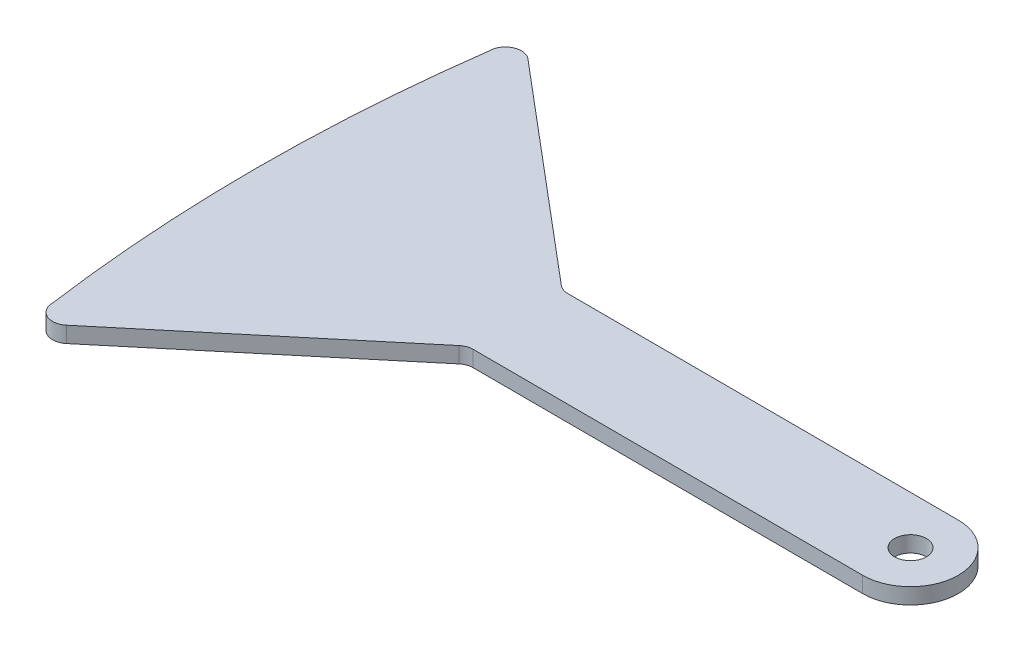
ISO-10303-21;
HEADER;
FILE_DESCRIPTION(('STEP AP214'),'2;1');
FILE_NAME('part.step','',(''),(''),'','','');
FILE_SCHEMA(('AUTOMOTIVE_DESIGN { 1 0 10303 214 1 1 1 1 }'));
ENDSEC;
DATA;
#1=APPLICATION_CONTEXT('core data for automotive mechanical design processes');
#2=APPLICATION_PROTOCOL_DEFINITION('international standard','automotive_design',2000,#1);
#3=PRODUCT_CONTEXT('',#1,'mechanical');
#4=PRODUCT('Part','Part','',(#3));
#5=PRODUCT_RELATED_PRODUCT_CATEGORY('part','',(#4));
#6=PRODUCT_DEFINITION_FORMATION('','',#4);
#7=PRODUCT_DEFINITION_CONTEXT('part definition',#1,'design');
#8=PRODUCT_DEFINITION('design','',#6,#7);
#9=PRODUCT_DEFINITION_SHAPE('','',#8);
#10=(LENGTH_UNIT() NAMED_UNIT(*) SI_UNIT(.MILLI.,.METRE.));
#11=(NAMED_UNIT(*) PLANE_ANGLE_UNIT() SI_UNIT($,.RADIAN.));
#12=(NAMED_UNIT(*) SI_UNIT($,.STERADIAN.) SOLID_ANGLE_UNIT());
#13=UNCERTAINTY_MEASURE_WITH_UNIT(LENGTH_MEASURE(1.E-05),#10,'distance_accuracy_value','');
#14=(GEOMETRIC_REPRESENTATION_CONTEXT(3) GLOBAL_UNCERTAINTY_ASSIGNED_CONTEXT((#13)) GLOBAL_UNIT_ASSIGNED_CONTEXT((#10,
#11,#12)) REPRESENTATION_CONTEXT('',''));
#15=CARTESIAN_POINT('',(0.,0.,0.));
#16=DIRECTION('',(0.,0.,1.));
#17=DIRECTION('',(1.,0.,0.));
#18=AXIS2_PLACEMENT_3D('',#15,#16,#17);
#19=CARTESIAN_POINT('',(25.,1.,0.));
#20=DIRECTION('',(0.,1.,0.));
#21=DIRECTION('',(0.,0.,1.));
#22=AXIS2_PLACEMENT_3D('',#19,#20,#21);
#23=PLANE('',#22);
#24=CARTESIAN_POINT('',(25.,1.,0.));
#25=DIRECTION('',(0.,1.,0.));
#26=DIRECTION('',(0.,0.,1.));
#27=AXIS2_PLACEMENT_3D('',#24,#25,#26);
#28=CIRCLE('',#27,3.);
#29=CARTESIAN_POINT('',(24.9930718982372,1.,2.99999200022366));
#30=VERTEX_POINT('',#29);
#31=CARTESIAN_POINT('',(25.0069281017628,1.,-2.99999200022366));
#32=VERTEX_POINT('',#31);
#33=EDGE_CURVE('E183',#30,#32,#28,.T.);
#34=ORIENTED_EDGE('',*,*,#33,.T.);
#35=DIRECTION('',(-0.999997333407887,0.,-0.00230936725425648));
#36=VECTOR('',#35,1.);
#37=CARTESIAN_POINT('',(0.435948957199872,1.,-3.05673556617708));
#38=LINE('',#37,#36);
#39=CARTESIAN_POINT('',(0.435948957199872,1.,-3.05673556617708));
#40=VERTEX_POINT('',#39);
#41=EDGE_CURVE('E107',#32,#40,#38,.T.);
#42=ORIENTED_EDGE('',*,*,#41,.T.);
#43=CARTESIAN_POINT('',(0.438258324454125,1.,-4.05673289958497));
#44=DIRECTION('',(0.,-1.,0.));
#45=DIRECTION('',(0.,0.,-1.));
#46=AXIS2_PLACEMENT_3D('',#43,#44,#45);
#47=CIRCLE('',#46,1.);
#48=CARTESIAN_POINT('',(-0.206296649132287,1.,-3.29217493185131));
#49=VERTEX_POINT('',#48);
#50=EDGE_CURVE('E233',#40,#49,#47,.T.);
#51=ORIENTED_EDGE('',*,*,#50,.T.);
#52=DIRECTION('',(-0.76455796773366,0.,-0.644554973586409));
#53=VECTOR('',#52,1.);
#54=CARTESIAN_POINT('',(-0.206296649132287,1.,-3.29217493185131));
#55=LINE('',#54,#53);
#56=CARTESIAN_POINT('',(-13.5746246875929,1.,-14.5622455993067));
#57=VERTEX_POINT('',#56);
#58=EDGE_CURVE('E229',#49,#57,#55,.T.);
#59=ORIENTED_EDGE('',*,*,#58,.T.);
#60=CARTESIAN_POINT('',(-14.2191796611794,1.,-13.7976876315731));
#61=DIRECTION('',(0.,1.,0.));
#62=DIRECTION('',(0.,0.,1.));
#63=AXIS2_PLACEMENT_3D('',#60,#61,#62);
#64=CIRCLE('',#63,1.);
#65=CARTESIAN_POINT('',(-15.2191796611794,1.,-13.7976876315731));
#66=VERTEX_POINT('',#65);
#67=EDGE_CURVE('E232',#57,#66,#64,.T.);
#68=ORIENTED_EDGE('',*,*,#67,.T.);
#69=CARTESIAN_POINT('',(84.655206124614,1.,-0.0864160862887996));
#70=DIRECTION('',(0.,1.,0.));
#71=DIRECTION('',(0.,0.,1.));
#72=AXIS2_PLACEMENT_3D('',#69,#70,#71);
#73=CIRCLE('',#72,100.811169537299);
#74=CARTESIAN_POINT('',(-15.2191796611794,1.,13.6248554589955));
#75=VERTEX_POINT('',#74);
#76=EDGE_CURVE('E237',#66,#75,#73,.T.);
#77=ORIENTED_EDGE('',*,*,#76,.T.);
#78=CARTESIAN_POINT('',(-14.2191796611794,1.,13.6248554589955));
#79=DIRECTION('',(0.,1.,0.));
#80=DIRECTION('',(0.,0.,1.));
#81=AXIS2_PLACEMENT_3D('',#78,#79,#80);
#82=CIRCLE('',#81,1.);
#83=CARTESIAN_POINT('',(-13.5781628434974,1.,14.3923822920436));
#84=VERTEX_POINT('',#83);
#85=EDGE_CURVE('E132',#75,#84,#82,.T.);
#86=ORIENTED_EDGE('',*,*,#85,.T.);
#87=DIRECTION('',(0.767526833048159,0.,-0.641016817681926));
#88=VECTOR('',#87,1.);
#89=CARTESIAN_POINT('',(-13.5781628434974,1.,14.3923822920436));
#90=LINE('',#89,#88);
#91=CARTESIAN_POINT('',(-0.147999921446321,1.,3.17588805815044));
#92=VERTEX_POINT('',#91);
#93=EDGE_CURVE('E126',#84,#92,#90,.T.);
#94=ORIENTED_EDGE('',*,*,#93,.T.);
#95=CARTESIAN_POINT('',(0.493016896235608,1.,3.9434148911986));
#96=DIRECTION('',(0.,-1.,0.));
#97=DIRECTION('',(0.,0.,1.));
#98=AXIS2_PLACEMENT_3D('',#95,#96,#97);
#99=CIRCLE('',#98,1.);
#100=CARTESIAN_POINT('',(0.495326263489868,1.,2.94341755779071));
#101=VERTEX_POINT('',#100);
#102=EDGE_CURVE('E130',#92,#101,#99,.T.);
#103=ORIENTED_EDGE('',*,*,#102,.T.);
#104=DIRECTION('',(0.999997333407887,0.,0.00230936725425651));
#105=VECTOR('',#104,1.);
#106=CARTESIAN_POINT('',(0.495326263489868,1.,2.94341755779071));
#107=LINE('',#106,#105);
#108=EDGE_CURVE('E57',#101,#30,#107,.T.);
#109=ORIENTED_EDGE('',*,*,#108,.T.);
#110=EDGE_LOOP('',(#34,#42,#51,#59,#68,#77,#86,#94,#103,#109));
#111=FACE_BOUND('',#110,.T.);
#112=CARTESIAN_POINT('',(25.,1.,0.));
#113=DIRECTION('',(0.,1.,0.));
#114=DIRECTION('',(0.,0.,1.));
#115=AXIS2_PLACEMENT_3D('',#112,#113,#114);
#116=CIRCLE('',#115,1.);
#117=CARTESIAN_POINT('',(25.,1.,1.));
#118=VERTEX_POINT('',#117);
#119=EDGE_CURVE('E159',#118,#118,#116,.T.);
#120=ORIENTED_EDGE('',*,*,#119,.F.);
#121=EDGE_LOOP('',(#120));
#122=FACE_BOUND('',#121,.T.);
#123=ADVANCED_FACE('F39',(#111,#122),#23,.T.);
#124=CARTESIAN_POINT('',(25.,0.,0.));
#125=DIRECTION('',(0.,1.,0.));
#126=DIRECTION('',(0.,0.,1.));
#127=AXIS2_PLACEMENT_3D('',#124,#125,#126);
#128=PLANE('',#127);
#129=CARTESIAN_POINT('',(0.,0.,0.));
#130=DIRECTION('',(0.,1.,0.));
#131=DIRECTION('',(0.,0.,1.));
#132=AXIS2_PLACEMENT_3D('',#129,#130,#131);
#133=CIRCLE('',#132,1.);
#134=CARTESIAN_POINT('',(0.,0.,1.));
#135=VERTEX_POINT('',#134);
#136=EDGE_CURVE('E11',#135,#135,#133,.F.);
#137=ORIENTED_EDGE('',*,*,#136,.F.);
#138=EDGE_LOOP('',(#137));
#139=FACE_BOUND('',#138,.T.);
#140=CARTESIAN_POINT('',(25.,0.,0.));
#141=DIRECTION('',(0.,1.,0.));
#142=DIRECTION('',(0.,0.,1.));
#143=AXIS2_PLACEMENT_3D('',#140,#141,#142);
#144=CIRCLE('',#143,3.);
#145=CARTESIAN_POINT('',(24.9930718982372,0.,2.99999200022366));
#146=VERTEX_POINT('',#145);
#147=CARTESIAN_POINT('',(25.0069281017628,0.,-2.99999200022366));
#148=VERTEX_POINT('',#147);
#149=EDGE_CURVE('E154',#146,#148,#144,.T.);
#150=ORIENTED_EDGE('',*,*,#149,.F.);
#151=DIRECTION('',(0.999997333407887,0.,0.00230936725425651));
#152=VECTOR('',#151,1.);
#153=CARTESIAN_POINT('',(0.495326263489868,0.,2.94341755779071));
#154=LINE('',#153,#152);
#155=CARTESIAN_POINT('',(0.495326263489868,0.,2.94341755779071));
#156=VERTEX_POINT('',#155);
#157=EDGE_CURVE('E98',#156,#146,#154,.T.);
#158=ORIENTED_EDGE('',*,*,#157,.F.);
#159=CARTESIAN_POINT('',(0.493016896235608,0.,3.9434148911986));
#160=DIRECTION('',(0.,-1.,0.));
#161=DIRECTION('',(0.,0.,1.));
#162=AXIS2_PLACEMENT_3D('',#159,#160,#161);
#163=CIRCLE('',#162,1.);
#164=CARTESIAN_POINT('',(-0.147999921446321,0.,3.17588805815044));
#165=VERTEX_POINT('',#164);
#166=EDGE_CURVE('E92',#165,#156,#163,.T.);
#167=ORIENTED_EDGE('',*,*,#166,.F.);
#168=DIRECTION('',(0.767526833048159,0.,-0.641016817681926));
#169=VECTOR('',#168,1.);
#170=CARTESIAN_POINT('',(-13.5781628434974,0.,14.3923822920436));
#171=LINE('',#170,#169);
#172=CARTESIAN_POINT('',(-13.5781628434974,0.,14.3923822920436));
#173=VERTEX_POINT('',#172);
#174=EDGE_CURVE('E141',#173,#165,#171,.T.);
#175=ORIENTED_EDGE('',*,*,#174,.F.);
#176=CARTESIAN_POINT('',(-14.2191796611794,0.,13.6248554589955));
#177=DIRECTION('',(0.,1.,0.));
#178=DIRECTION('',(0.,0.,1.));
#179=AXIS2_PLACEMENT_3D('',#176,#177,#178);
#180=CIRCLE('',#179,1.);
#181=CARTESIAN_POINT('',(-15.2191796611794,0.,13.6248554589955));
#182=VERTEX_POINT('',#181);
#183=EDGE_CURVE('E174',#182,#173,#180,.T.);
#184=ORIENTED_EDGE('',*,*,#183,.F.);
#185=CARTESIAN_POINT('',(84.655206124614,0.,-0.0864160862887996));
#186=DIRECTION('',(0.,1.,0.));
#187=DIRECTION('',(0.,0.,1.));
#188=AXIS2_PLACEMENT_3D('',#185,#186,#187);
#189=CIRCLE('',#188,100.811169537299);
#190=CARTESIAN_POINT('',(-15.2191796611794,0.,-13.7976876315731));
#191=VERTEX_POINT('',#190);
#192=EDGE_CURVE('E171',#191,#182,#189,.T.);
#193=ORIENTED_EDGE('',*,*,#192,.F.);
#194=CARTESIAN_POINT('',(-14.2191796611794,0.,-13.7976876315731));
#195=DIRECTION('',(0.,1.,0.));
#196=DIRECTION('',(0.,0.,1.));
#197=AXIS2_PLACEMENT_3D('',#194,#195,#196);
#198=CIRCLE('',#197,1.);
#199=CARTESIAN_POINT('',(-13.5746246875929,0.,-14.5622455993067));
#200=VERTEX_POINT('',#199);
#201=EDGE_CURVE('E168',#200,#191,#198,.T.);
#202=ORIENTED_EDGE('',*,*,#201,.F.);
#203=DIRECTION('',(-0.76455796773366,0.,-0.644554973586409));
#204=VECTOR('',#203,1.);
#205=CARTESIAN_POINT('',(-0.206296649132287,0.,-3.29217493185131));
#206=LINE('',#205,#204);
#207=CARTESIAN_POINT('',(-0.206296649132287,0.,-3.29217493185131));
#208=VERTEX_POINT('',#207);
#209=EDGE_CURVE('E165',#208,#200,#206,.T.);
#210=ORIENTED_EDGE('',*,*,#209,.F.);
#211=CARTESIAN_POINT('',(0.438258324454125,0.,-4.05673289958497));
#212=DIRECTION('',(0.,-1.,0.));
#213=DIRECTION('',(0.,0.,-1.));
#214=AXIS2_PLACEMENT_3D('',#211,#212,#213);
#215=CIRCLE('',#214,1.);
#216=CARTESIAN_POINT('',(0.435948957199872,0.,-3.05673556617708));
#217=VERTEX_POINT('',#216);
#218=EDGE_CURVE('E162',#217,#208,#215,.T.);
#219=ORIENTED_EDGE('',*,*,#218,.F.);
#220=DIRECTION('',(-0.999997333407887,0.,-0.00230936725425648));
#221=VECTOR('',#220,1.);
#222=CARTESIAN_POINT('',(0.435948957199872,0.,-3.05673556617708));
#223=LINE('',#222,#221);
#224=EDGE_CURVE('E158',#148,#217,#223,.T.);
#225=ORIENTED_EDGE('',*,*,#224,.F.);
#226=EDGE_LOOP('',(#150,#158,#167,#175,#184,#193,#202,#210,#219,#225));
#227=FACE_BOUND('',#226,.T.);
#228=CARTESIAN_POINT('',(25.,0.,0.));
#229=DIRECTION('',(0.,1.,0.));
#230=DIRECTION('',(0.,0.,1.));
#231=AXIS2_PLACEMENT_3D('',#228,#229,#230);
#232=CIRCLE('',#231,1.);
#233=CARTESIAN_POINT('',(25.,0.,1.));
#234=VERTEX_POINT('',#233);
#235=EDGE_CURVE('E391',#234,#234,#232,.T.);
#236=ORIENTED_EDGE('',*,*,#235,.T.);
#237=EDGE_LOOP('',(#236));
#238=FACE_BOUND('',#237,.T.);
#239=ADVANCED_FACE('F216',(#139,#227,#238),#128,.F.);
#240=CARTESIAN_POINT('',(25.,1.,0.));
#241=DIRECTION('',(0.,-1.,0.));
#242=DIRECTION('',(0.,0.,-1.));
#243=AXIS2_PLACEMENT_3D('',#240,#241,#242);
#244=CYLINDRICAL_SURFACE('',#243,3.);
#245=ORIENTED_EDGE('',*,*,#149,.T.);
#246=DIRECTION('',(0.,-1.,0.));
#247=VECTOR('',#246,1.);
#248=CARTESIAN_POINT('',(25.0069281017628,1.,-2.99999200022366));
#249=LINE('',#248,#247);
#250=EDGE_CURVE('E49',#32,#148,#249,.T.);
#251=ORIENTED_EDGE('',*,*,#250,.F.);
#252=ORIENTED_EDGE('',*,*,#33,.F.);
#253=DIRECTION('',(0.,-1.,0.));
#254=VECTOR('',#253,1.);
#255=CARTESIAN_POINT('',(24.9930718982372,1.,2.99999200022366));
#256=LINE('',#255,#254);
#257=EDGE_CURVE('E150',#30,#146,#256,.T.);
#258=ORIENTED_EDGE('',*,*,#257,.T.);
#259=EDGE_LOOP('',(#245,#251,#252,#258));
#260=FACE_BOUND('',#259,.T.);
#261=ADVANCED_FACE('F41',(#260),#244,.T.);
#262=CARTESIAN_POINT('',(0.435948957199872,1.,-3.05673556617708));
#263=DIRECTION('',(-0.00230936725425648,0.,0.999997333407887));
#264=DIRECTION('',(0.999997333407887,0.,0.00230936725425648));
#265=AXIS2_PLACEMENT_3D('',#262,#263,#264);
#266=PLANE('',#265);
#267=ORIENTED_EDGE('',*,*,#224,.T.);
#268=DIRECTION('',(0.,-1.,0.));
#269=VECTOR('',#268,1.);
#270=CARTESIAN_POINT('',(0.435948957199872,1.,-3.05673556617708));
#271=LINE('',#270,#269);
#272=EDGE_CURVE('E206',#40,#217,#271,.T.);
#273=ORIENTED_EDGE('',*,*,#272,.F.);
#274=ORIENTED_EDGE('',*,*,#41,.F.);
#275=ORIENTED_EDGE('',*,*,#250,.T.);
#276=EDGE_LOOP('',(#267,#273,#274,#275));
#277=FACE_BOUND('',#276,.T.);
#278=ADVANCED_FACE('F211',(#277),#266,.F.);
#279=CARTESIAN_POINT('',(0.438258324454125,1.,-4.05673289958497));
#280=DIRECTION('',(0.,-1.,0.));
#281=DIRECTION('',(0.,0.,-1.));
#282=AXIS2_PLACEMENT_3D('',#279,#280,#281);
#283=CYLINDRICAL_SURFACE('',#282,1.);
#284=ORIENTED_EDGE('',*,*,#218,.T.);
#285=DIRECTION('',(0.,-1.,0.));
#286=VECTOR('',#285,1.);
#287=CARTESIAN_POINT('',(-0.206296649132287,1.,-3.29217493185131));
#288=LINE('',#287,#286);
#289=EDGE_CURVE('E202',#49,#208,#288,.T.);
#290=ORIENTED_EDGE('',*,*,#289,.F.);
#291=ORIENTED_EDGE('',*,*,#50,.F.);
#292=ORIENTED_EDGE('',*,*,#272,.T.);
#293=EDGE_LOOP('',(#284,#290,#291,#292));
#294=FACE_BOUND('',#293,.T.);
#295=ADVANCED_FACE('F223',(#294),#283,.F.);
#296=CARTESIAN_POINT('',(-0.206296649132287,1.,-3.29217493185131));
#297=DIRECTION('',(-0.644554973586409,0.,0.76455796773366));
#298=DIRECTION('',(0.76455796773366,0.,0.644554973586409));
#299=AXIS2_PLACEMENT_3D('',#296,#297,#298);
#300=PLANE('',#299);
#301=ORIENTED_EDGE('',*,*,#209,.T.);
#302=DIRECTION('',(0.,-1.,0.));
#303=VECTOR('',#302,1.);
#304=CARTESIAN_POINT('',(-13.5746246875929,1.,-14.5622455993067));
#305=LINE('',#304,#303);
#306=EDGE_CURVE('E198',#57,#200,#305,.T.);
#307=ORIENTED_EDGE('',*,*,#306,.F.);
#308=ORIENTED_EDGE('',*,*,#58,.F.);
#309=ORIENTED_EDGE('',*,*,#289,.T.);
#310=EDGE_LOOP('',(#301,#307,#308,#309));
#311=FACE_BOUND('',#310,.T.);
#312=ADVANCED_FACE('F227',(#311),#300,.F.);
#313=CARTESIAN_POINT('',(-14.2191796611794,1.,-13.7976876315731));
#314=DIRECTION('',(0.,-1.,0.));
#315=DIRECTION('',(0.,0.,-1.));
#316=AXIS2_PLACEMENT_3D('',#313,#314,#315);
#317=CYLINDRICAL_SURFACE('',#316,1.);
#318=ORIENTED_EDGE('',*,*,#201,.T.);
#319=DIRECTION('',(0.,-1.,0.));
#320=VECTOR('',#319,1.);
#321=CARTESIAN_POINT('',(-15.2191796611794,1.,-13.7976876315731));
#322=LINE('',#321,#320);
#323=EDGE_CURVE('E194',#66,#191,#322,.T.);
#324=ORIENTED_EDGE('',*,*,#323,.F.);
#325=ORIENTED_EDGE('',*,*,#67,.F.);
#326=ORIENTED_EDGE('',*,*,#306,.T.);
#327=EDGE_LOOP('',(#318,#324,#325,#326));
#328=FACE_BOUND('',#327,.T.);
#329=ADVANCED_FACE('F254',(#328),#317,.T.);
#330=CARTESIAN_POINT('',(84.655206124614,1.,-0.0864160862887996));
#331=DIRECTION('',(0.,-1.,0.));
#332=DIRECTION('',(0.,0.,-1.));
#333=AXIS2_PLACEMENT_3D('',#330,#331,#332);
#334=CYLINDRICAL_SURFACE('',#333,100.811169537299);
#335=ORIENTED_EDGE('',*,*,#192,.T.);
#336=DIRECTION('',(0.,-1.,0.));
#337=VECTOR('',#336,1.);
#338=CARTESIAN_POINT('',(-15.2191796611794,1.,13.6248554589955));
#339=LINE('',#338,#337);
#340=EDGE_CURVE('E190',#75,#182,#339,.T.);
#341=ORIENTED_EDGE('',*,*,#340,.F.);
#342=ORIENTED_EDGE('',*,*,#76,.F.);
#343=ORIENTED_EDGE('',*,*,#323,.T.);
#344=EDGE_LOOP('',(#335,#341,#342,#343));
#345=FACE_BOUND('',#344,.T.);
#346=ADVANCED_FACE('F248',(#345),#334,.T.);
#347=CARTESIAN_POINT('',(-14.2191796611794,1.,13.6248554589955));
#348=DIRECTION('',(0.,-1.,0.));
#349=DIRECTION('',(0.,0.,-1.));
#350=AXIS2_PLACEMENT_3D('',#347,#348,#349);
#351=CYLINDRICAL_SURFACE('',#350,1.);
#352=ORIENTED_EDGE('',*,*,#183,.T.);
#353=DIRECTION('',(0.,-1.,0.));
#354=VECTOR('',#353,1.);
#355=CARTESIAN_POINT('',(-13.5781628434974,1.,14.3923822920436));
#356=LINE('',#355,#354);
#357=EDGE_CURVE('E143',#84,#173,#356,.T.);
#358=ORIENTED_EDGE('',*,*,#357,.F.);
#359=ORIENTED_EDGE('',*,*,#85,.F.);
#360=ORIENTED_EDGE('',*,*,#340,.T.);
#361=EDGE_LOOP('',(#352,#358,#359,#360));
#362=FACE_BOUND('',#361,.T.);
#363=ADVANCED_FACE('F252',(#362),#351,.T.);
#364=CARTESIAN_POINT('',(-13.5781628434974,1.,14.3923822920436));
#365=DIRECTION('',(-0.641016817681926,0.,-0.767526833048159));
#366=DIRECTION('',(-0.767526833048159,0.,0.641016817681926));
#367=AXIS2_PLACEMENT_3D('',#364,#365,#366);
#368=PLANE('',#367);
#369=ORIENTED_EDGE('',*,*,#174,.T.);
#370=DIRECTION('',(0.,-1.,0.));
#371=VECTOR('',#370,1.);
#372=CARTESIAN_POINT('',(-0.147999921446321,1.,3.17588805815044));
#373=LINE('',#372,#371);
#374=EDGE_CURVE('E138',#92,#165,#373,.T.);
#375=ORIENTED_EDGE('',*,*,#374,.F.);
#376=ORIENTED_EDGE('',*,*,#93,.F.);
#377=ORIENTED_EDGE('',*,*,#357,.T.);
#378=EDGE_LOOP('',(#369,#375,#376,#377));
#379=FACE_BOUND('',#378,.T.);
#380=ADVANCED_FACE('F139',(#379),#368,.F.);
#381=CARTESIAN_POINT('',(0.493016896235608,1.,3.9434148911986));
#382=DIRECTION('',(0.,-1.,0.));
#383=DIRECTION('',(0.,0.,-1.));
#384=AXIS2_PLACEMENT_3D('',#381,#382,#383);
#385=CYLINDRICAL_SURFACE('',#384,1.);
#386=ORIENTED_EDGE('',*,*,#166,.T.);
#387=DIRECTION('',(0.,-1.,0.));
#388=VECTOR('',#387,1.);
#389=CARTESIAN_POINT('',(0.495326263489868,1.,2.94341755779071));
#390=LINE('',#389,#388);
#391=EDGE_CURVE('E144',#101,#156,#390,.T.);
#392=ORIENTED_EDGE('',*,*,#391,.F.);
#393=ORIENTED_EDGE('',*,*,#102,.F.);
#394=ORIENTED_EDGE('',*,*,#374,.T.);
#395=EDGE_LOOP('',(#386,#392,#393,#394));
#396=FACE_BOUND('',#395,.T.);
#397=ADVANCED_FACE('F146',(#396),#385,.F.);
#398=CARTESIAN_POINT('',(0.495326263489868,1.,2.94341755779071));
#399=DIRECTION('',(0.00230936725425651,0.,-0.999997333407887));
#400=DIRECTION('',(-0.999997333407887,0.,-0.00230936725425651));
#401=AXIS2_PLACEMENT_3D('',#398,#399,#400);
#402=PLANE('',#401);
#403=ORIENTED_EDGE('',*,*,#157,.T.);
#404=ORIENTED_EDGE('',*,*,#257,.F.);
#405=ORIENTED_EDGE('',*,*,#108,.F.);
#406=ORIENTED_EDGE('',*,*,#391,.T.);
#407=EDGE_LOOP('',(#403,#404,#405,#406));
#408=FACE_BOUND('',#407,.T.);
#409=ADVANCED_FACE('F274',(#408),#402,.F.);
#410=CARTESIAN_POINT('',(25.,1.,0.));
#411=DIRECTION('',(0.,-1.,0.));
#412=DIRECTION('',(0.,0.,-1.));
#413=AXIS2_PLACEMENT_3D('',#410,#411,#412);
#414=CYLINDRICAL_SURFACE('',#413,1.);
#415=ORIENTED_EDGE('',*,*,#119,.T.);
#416=EDGE_LOOP('',(#415));
#417=FACE_BOUND('',#416,.T.);
#418=ORIENTED_EDGE('',*,*,#235,.F.);
#419=EDGE_LOOP('',(#418));
#420=FACE_BOUND('',#419,.T.);
#421=ADVANCED_FACE('F271',(#417,#420),#414,.F.);
#422=CARTESIAN_POINT('',(0.,-1.,0.));
#423=DIRECTION('',(0.,1.,0.));
#424=DIRECTION('',(0.,0.,1.));
#425=AXIS2_PLACEMENT_3D('',#422,#423,#424);
#426=CYLINDRICAL_SURFACE('',#425,1.);
#427=CARTESIAN_POINT('',(0.,-1.,0.));
#428=DIRECTION('',(0.,-1.,0.));
#429=DIRECTION('',(0.,0.,-1.));
#430=AXIS2_PLACEMENT_3D('',#427,#428,#429);
#431=CIRCLE('',#430,1.);
#432=CARTESIAN_POINT('',(0.,-1.,-1.));
#433=VERTEX_POINT('',#432);
#434=EDGE_CURVE('E389',#433,#433,#431,.T.);
#435=ORIENTED_EDGE('',*,*,#434,.F.);
#436=EDGE_LOOP('',(#435));
#437=FACE_BOUND('',#436,.T.);
#438=ORIENTED_EDGE('',*,*,#136,.T.);
#439=EDGE_LOOP('',(#438));
#440=FACE_BOUND('',#439,.T.);
#441=ADVANCED_FACE('F304',(#437,#440),#426,.T.);
#442=CARTESIAN_POINT('',(0.,-1.,0.));
#443=DIRECTION('',(0.,-1.,0.));
#444=DIRECTION('',(0.,0.,-1.));
#445=AXIS2_PLACEMENT_3D('',#442,#443,#444);
#446=PLANE('',#445);
#447=ORIENTED_EDGE('',*,*,#434,.T.);
#448=EDGE_LOOP('',(#447));
#449=FACE_BOUND('',#448,.T.);
#450=ADVANCED_FACE('F312',(#449),#446,.T.);
#451=CLOSED_SHELL('',(#123,#239,#261,#278,#295,#312,#329,#346,#363,#380,#397,#409,#421,#441,#450));
#452=MANIFOLD_SOLID_BREP('B2',#451);
#453=ADVANCED_BREP_SHAPE_REPRESENTATION('',(#18,#452),#14);
#454=SHAPE_DEFINITION_REPRESENTATION(#9,#453);
ENDSEC;
END-ISO-10303-21;
